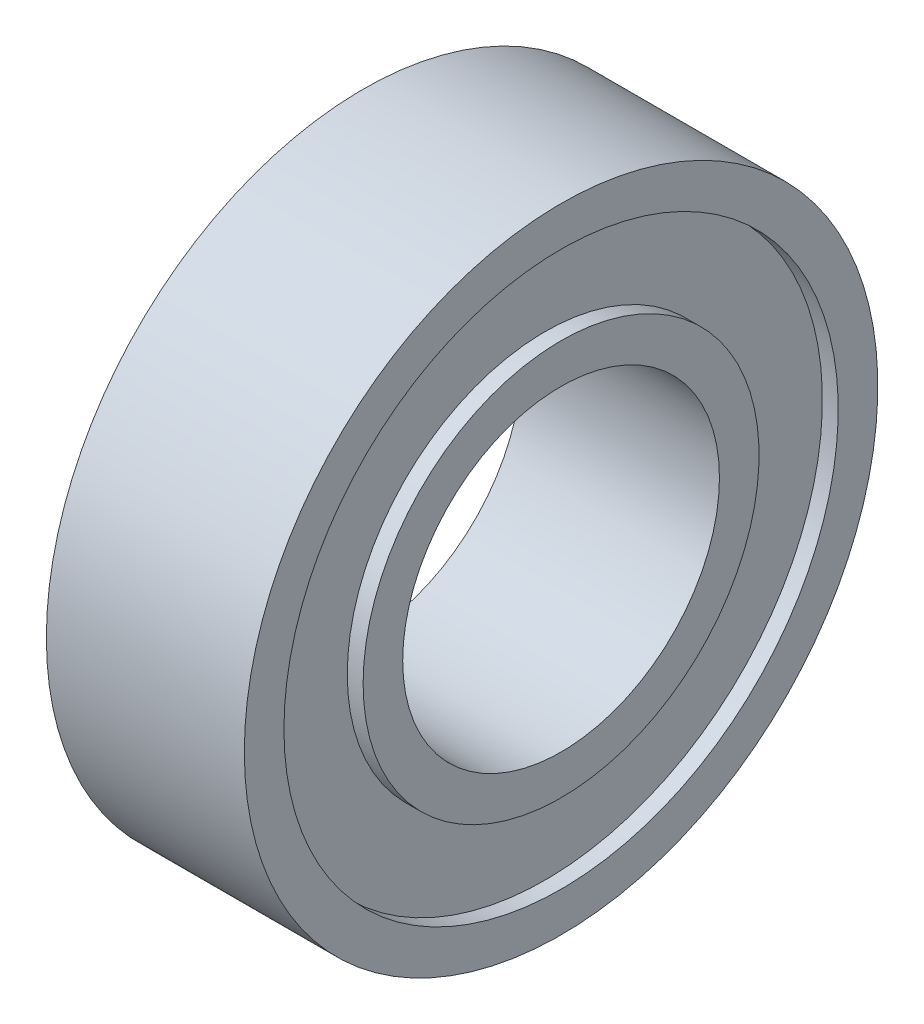
ISO-10303-21;
HEADER;
FILE_DESCRIPTION(('STEP AP214'),'2;1');
FILE_NAME('part.step','',(''),(''),'','','');
FILE_SCHEMA(('AUTOMOTIVE_DESIGN { 1 0 10303 214 1 1 1 1 }'));
ENDSEC;
DATA;
#1=APPLICATION_CONTEXT('core data for automotive mechanical design processes');
#2=APPLICATION_PROTOCOL_DEFINITION('international standard','automotive_design',2000,#1);
#3=PRODUCT_CONTEXT('',#1,'mechanical');
#4=PRODUCT('Part','Part','',(#3));
#5=PRODUCT_RELATED_PRODUCT_CATEGORY('part','',(#4));
#6=PRODUCT_DEFINITION_FORMATION('','',#4);
#7=PRODUCT_DEFINITION_CONTEXT('part definition',#1,'design');
#8=PRODUCT_DEFINITION('design','',#6,#7);
#9=PRODUCT_DEFINITION_SHAPE('','',#8);
#10=(LENGTH_UNIT() NAMED_UNIT(*) SI_UNIT(.MILLI.,.METRE.));
#11=(NAMED_UNIT(*) PLANE_ANGLE_UNIT() SI_UNIT($,.RADIAN.));
#12=(NAMED_UNIT(*) SI_UNIT($,.STERADIAN.) SOLID_ANGLE_UNIT());
#13=UNCERTAINTY_MEASURE_WITH_UNIT(LENGTH_MEASURE(1.E-05),#10,'distance_accuracy_value','');
#14=(GEOMETRIC_REPRESENTATION_CONTEXT(3) GLOBAL_UNCERTAINTY_ASSIGNED_CONTEXT((#13)) GLOBAL_UNIT_ASSIGNED_CONTEXT((#10,
#11,#12)) REPRESENTATION_CONTEXT('',''));
#15=CARTESIAN_POINT('',(0.,0.,0.));
#16=DIRECTION('',(0.,0.,1.));
#17=DIRECTION('',(1.,0.,0.));
#18=AXIS2_PLACEMENT_3D('',#15,#16,#17);
#19=CARTESIAN_POINT('',(-2.5,8.,0.));
#20=DIRECTION('',(1.,0.,0.));
#21=DIRECTION('',(0.,0.,-1.));
#22=AXIS2_PLACEMENT_3D('',#19,#20,#21);
#23=PLANE('',#22);
#24=CARTESIAN_POINT('',(-2.5,0.,0.));
#25=DIRECTION('',(-1.,0.,0.));
#26=DIRECTION('',(0.,0.,1.));
#27=AXIS2_PLACEMENT_3D('',#24,#25,#26);
#28=CIRCLE('',#27,7.);
#29=CARTESIAN_POINT('',(-2.5,0.,7.));
#30=VERTEX_POINT('',#29);
#31=EDGE_CURVE('E10',#30,#30,#28,.T.);
#32=ORIENTED_EDGE('',*,*,#31,.F.);
#33=EDGE_LOOP('',(#32));
#34=FACE_BOUND('',#33,.T.);
#35=CARTESIAN_POINT('',(-2.5,0.,0.));
#36=DIRECTION('',(-1.,0.,0.));
#37=DIRECTION('',(0.,0.,1.));
#38=AXIS2_PLACEMENT_3D('',#35,#36,#37);
#39=CIRCLE('',#38,8.);
#40=CARTESIAN_POINT('',(-2.5,0.,8.));
#41=VERTEX_POINT('',#40);
#42=EDGE_CURVE('E69',#41,#41,#39,.T.);
#43=ORIENTED_EDGE('',*,*,#42,.T.);
#44=EDGE_LOOP('',(#43));
#45=FACE_BOUND('',#44,.T.);
#46=ADVANCED_FACE('F29',(#34,#45),#23,.F.);
#47=CARTESIAN_POINT('',(-2.5,0.,0.));
#48=DIRECTION('',(-1.,0.,0.));
#49=DIRECTION('',(0.,0.,1.));
#50=AXIS2_PLACEMENT_3D('',#47,#48,#49);
#51=CYLINDRICAL_SURFACE('',#50,7.);
#52=CARTESIAN_POINT('',(-2.1,0.,0.));
#53=DIRECTION('',(-1.,0.,0.));
#54=DIRECTION('',(0.,0.,1.));
#55=AXIS2_PLACEMENT_3D('',#52,#53,#54);
#56=CIRCLE('',#55,7.);
#57=CARTESIAN_POINT('',(-2.1,0.,7.));
#58=VERTEX_POINT('',#57);
#59=EDGE_CURVE('E35',#58,#58,#56,.T.);
#60=ORIENTED_EDGE('',*,*,#59,.F.);
#61=EDGE_LOOP('',(#60));
#62=FACE_BOUND('',#61,.T.);
#63=ORIENTED_EDGE('',*,*,#31,.T.);
#64=EDGE_LOOP('',(#63));
#65=FACE_BOUND('',#64,.T.);
#66=ADVANCED_FACE('F130',(#62,#65),#51,.F.);
#67=CARTESIAN_POINT('',(-2.1,5.,0.));
#68=DIRECTION('',(1.,0.,0.));
#69=DIRECTION('',(0.,0.,-1.));
#70=AXIS2_PLACEMENT_3D('',#67,#68,#69);
#71=PLANE('',#70);
#72=CARTESIAN_POINT('',(-2.1,0.,0.));
#73=DIRECTION('',(-1.,0.,0.));
#74=DIRECTION('',(0.,0.,1.));
#75=AXIS2_PLACEMENT_3D('',#72,#73,#74);
#76=CIRCLE('',#75,5.);
#77=CARTESIAN_POINT('',(-2.1,0.,5.));
#78=VERTEX_POINT('',#77);
#79=EDGE_CURVE('E39',#78,#78,#76,.T.);
#80=ORIENTED_EDGE('',*,*,#79,.F.);
#81=EDGE_LOOP('',(#80));
#82=FACE_BOUND('',#81,.T.);
#83=ORIENTED_EDGE('',*,*,#59,.T.);
#84=EDGE_LOOP('',(#83));
#85=FACE_BOUND('',#84,.T.);
#86=ADVANCED_FACE('F125',(#82,#85),#71,.F.);
#87=CARTESIAN_POINT('',(-2.5,0.,0.));
#88=DIRECTION('',(-1.,0.,0.));
#89=DIRECTION('',(0.,0.,1.));
#90=AXIS2_PLACEMENT_3D('',#87,#88,#89);
#91=CYLINDRICAL_SURFACE('',#90,5.);
#92=CARTESIAN_POINT('',(-2.5,0.,0.));
#93=DIRECTION('',(-1.,0.,0.));
#94=DIRECTION('',(0.,0.,1.));
#95=AXIS2_PLACEMENT_3D('',#92,#93,#94);
#96=CIRCLE('',#95,5.);
#97=CARTESIAN_POINT('',(-2.5,0.,5.));
#98=VERTEX_POINT('',#97);
#99=EDGE_CURVE('E43',#98,#98,#96,.T.);
#100=ORIENTED_EDGE('',*,*,#99,.F.);
#101=EDGE_LOOP('',(#100));
#102=FACE_BOUND('',#101,.T.);
#103=ORIENTED_EDGE('',*,*,#79,.T.);
#104=EDGE_LOOP('',(#103));
#105=FACE_BOUND('',#104,.T.);
#106=ADVANCED_FACE('F119',(#102,#105),#91,.T.);
#107=CARTESIAN_POINT('',(-2.5,5.,0.));
#108=DIRECTION('',(1.,0.,0.));
#109=DIRECTION('',(0.,0.,-1.));
#110=AXIS2_PLACEMENT_3D('',#107,#108,#109);
#111=PLANE('',#110);
#112=CARTESIAN_POINT('',(-2.5,0.,0.));
#113=DIRECTION('',(-1.,0.,0.));
#114=DIRECTION('',(0.,0.,1.));
#115=AXIS2_PLACEMENT_3D('',#112,#113,#114);
#116=CIRCLE('',#115,4.);
#117=CARTESIAN_POINT('',(-2.5,0.,4.));
#118=VERTEX_POINT('',#117);
#119=EDGE_CURVE('E48',#118,#118,#116,.T.);
#120=ORIENTED_EDGE('',*,*,#119,.F.);
#121=EDGE_LOOP('',(#120));
#122=FACE_BOUND('',#121,.T.);
#123=ORIENTED_EDGE('',*,*,#99,.T.);
#124=EDGE_LOOP('',(#123));
#125=FACE_BOUND('',#124,.T.);
#126=ADVANCED_FACE('F113',(#122,#125),#111,.F.);
#127=CARTESIAN_POINT('',(-2.5,0.,0.));
#128=DIRECTION('',(-1.,0.,0.));
#129=DIRECTION('',(0.,0.,1.));
#130=AXIS2_PLACEMENT_3D('',#127,#128,#129);
#131=CYLINDRICAL_SURFACE('',#130,4.);
#132=CARTESIAN_POINT('',(2.5,0.,0.));
#133=DIRECTION('',(-1.,0.,0.));
#134=DIRECTION('',(0.,0.,1.));
#135=AXIS2_PLACEMENT_3D('',#132,#133,#134);
#136=CIRCLE('',#135,4.);
#137=CARTESIAN_POINT('',(2.5,0.,4.));
#138=VERTEX_POINT('',#137);
#139=EDGE_CURVE('E51',#138,#138,#136,.T.);
#140=ORIENTED_EDGE('',*,*,#139,.F.);
#141=EDGE_LOOP('',(#140));
#142=FACE_BOUND('',#141,.T.);
#143=ORIENTED_EDGE('',*,*,#119,.T.);
#144=EDGE_LOOP('',(#143));
#145=FACE_BOUND('',#144,.T.);
#146=ADVANCED_FACE('F107',(#142,#145),#131,.F.);
#147=CARTESIAN_POINT('',(2.5,5.,0.));
#148=DIRECTION('',(-1.,0.,0.));
#149=DIRECTION('',(0.,0.,1.));
#150=AXIS2_PLACEMENT_3D('',#147,#148,#149);
#151=PLANE('',#150);
#152=CARTESIAN_POINT('',(2.5,0.,0.));
#153=DIRECTION('',(-1.,0.,0.));
#154=DIRECTION('',(0.,0.,1.));
#155=AXIS2_PLACEMENT_3D('',#152,#153,#154);
#156=CIRCLE('',#155,5.);
#157=CARTESIAN_POINT('',(2.5,0.,5.));
#158=VERTEX_POINT('',#157);
#159=EDGE_CURVE('E54',#158,#158,#156,.T.);
#160=ORIENTED_EDGE('',*,*,#159,.F.);
#161=EDGE_LOOP('',(#160));
#162=FACE_BOUND('',#161,.T.);
#163=ORIENTED_EDGE('',*,*,#139,.T.);
#164=EDGE_LOOP('',(#163));
#165=FACE_BOUND('',#164,.T.);
#166=ADVANCED_FACE('F101',(#162,#165),#151,.F.);
#167=CARTESIAN_POINT('',(-2.5,0.,0.));
#168=DIRECTION('',(-1.,0.,0.));
#169=DIRECTION('',(0.,0.,1.));
#170=AXIS2_PLACEMENT_3D('',#167,#168,#169);
#171=CYLINDRICAL_SURFACE('',#170,5.);
#172=CARTESIAN_POINT('',(2.1,0.,0.));
#173=DIRECTION('',(-1.,0.,0.));
#174=DIRECTION('',(0.,0.,1.));
#175=AXIS2_PLACEMENT_3D('',#172,#173,#174);
#176=CIRCLE('',#175,5.);
#177=CARTESIAN_POINT('',(2.1,0.,5.));
#178=VERTEX_POINT('',#177);
#179=EDGE_CURVE('E57',#178,#178,#176,.T.);
#180=ORIENTED_EDGE('',*,*,#179,.F.);
#181=EDGE_LOOP('',(#180));
#182=FACE_BOUND('',#181,.T.);
#183=ORIENTED_EDGE('',*,*,#159,.T.);
#184=EDGE_LOOP('',(#183));
#185=FACE_BOUND('',#184,.T.);
#186=ADVANCED_FACE('F95',(#182,#185),#171,.T.);
#187=CARTESIAN_POINT('',(2.1,7.,0.));
#188=DIRECTION('',(-1.,0.,0.));
#189=DIRECTION('',(0.,0.,1.));
#190=AXIS2_PLACEMENT_3D('',#187,#188,#189);
#191=PLANE('',#190);
#192=CARTESIAN_POINT('',(2.1,0.,0.));
#193=DIRECTION('',(-1.,0.,0.));
#194=DIRECTION('',(0.,0.,1.));
#195=AXIS2_PLACEMENT_3D('',#192,#193,#194);
#196=CIRCLE('',#195,7.);
#197=CARTESIAN_POINT('',(2.1,0.,7.));
#198=VERTEX_POINT('',#197);
#199=EDGE_CURVE('E60',#198,#198,#196,.T.);
#200=ORIENTED_EDGE('',*,*,#199,.F.);
#201=EDGE_LOOP('',(#200));
#202=FACE_BOUND('',#201,.T.);
#203=ORIENTED_EDGE('',*,*,#179,.T.);
#204=EDGE_LOOP('',(#203));
#205=FACE_BOUND('',#204,.T.);
#206=ADVANCED_FACE('F89',(#202,#205),#191,.F.);
#207=CARTESIAN_POINT('',(-2.5,0.,0.));
#208=DIRECTION('',(-1.,0.,0.));
#209=DIRECTION('',(0.,0.,1.));
#210=AXIS2_PLACEMENT_3D('',#207,#208,#209);
#211=CYLINDRICAL_SURFACE('',#210,7.);
#212=CARTESIAN_POINT('',(2.5,0.,0.));
#213=DIRECTION('',(-1.,0.,0.));
#214=DIRECTION('',(0.,0.,1.));
#215=AXIS2_PLACEMENT_3D('',#212,#213,#214);
#216=CIRCLE('',#215,7.);
#217=CARTESIAN_POINT('',(2.5,0.,7.));
#218=VERTEX_POINT('',#217);
#219=EDGE_CURVE('E63',#218,#218,#216,.T.);
#220=ORIENTED_EDGE('',*,*,#219,.F.);
#221=EDGE_LOOP('',(#220));
#222=FACE_BOUND('',#221,.T.);
#223=ORIENTED_EDGE('',*,*,#199,.T.);
#224=EDGE_LOOP('',(#223));
#225=FACE_BOUND('',#224,.T.);
#226=ADVANCED_FACE('F83',(#222,#225),#211,.F.);
#227=CARTESIAN_POINT('',(2.5,8.,0.));
#228=DIRECTION('',(-1.,0.,0.));
#229=DIRECTION('',(0.,0.,1.));
#230=AXIS2_PLACEMENT_3D('',#227,#228,#229);
#231=PLANE('',#230);
#232=CARTESIAN_POINT('',(2.5,0.,0.));
#233=DIRECTION('',(-1.,0.,0.));
#234=DIRECTION('',(0.,0.,1.));
#235=AXIS2_PLACEMENT_3D('',#232,#233,#234);
#236=CIRCLE('',#235,8.);
#237=CARTESIAN_POINT('',(2.5,0.,8.));
#238=VERTEX_POINT('',#237);
#239=EDGE_CURVE('E66',#238,#238,#236,.T.);
#240=ORIENTED_EDGE('',*,*,#239,.F.);
#241=EDGE_LOOP('',(#240));
#242=FACE_BOUND('',#241,.T.);
#243=ORIENTED_EDGE('',*,*,#219,.T.);
#244=EDGE_LOOP('',(#243));
#245=FACE_BOUND('',#244,.T.);
#246=ADVANCED_FACE('F77',(#242,#245),#231,.F.);
#247=CARTESIAN_POINT('',(-2.5,0.,0.));
#248=DIRECTION('',(-1.,0.,0.));
#249=DIRECTION('',(0.,0.,1.));
#250=AXIS2_PLACEMENT_3D('',#247,#248,#249);
#251=CYLINDRICAL_SURFACE('',#250,8.);
#252=ORIENTED_EDGE('',*,*,#42,.F.);
#253=EDGE_LOOP('',(#252));
#254=FACE_BOUND('',#253,.T.);
#255=ORIENTED_EDGE('',*,*,#239,.T.);
#256=EDGE_LOOP('',(#255));
#257=FACE_BOUND('',#256,.T.);
#258=ADVANCED_FACE('F74',(#254,#257),#251,.T.);
#259=CLOSED_SHELL('',(#46,#66,#86,#106,#126,#146,#166,#186,#206,#226,#246,#258));
#260=MANIFOLD_SOLID_BREP('B2',#259);
#261=ADVANCED_BREP_SHAPE_REPRESENTATION('',(#18,#260),#14);
#262=SHAPE_DEFINITION_REPRESENTATION(#9,#261);
ENDSEC;
END-ISO-10303-21;
